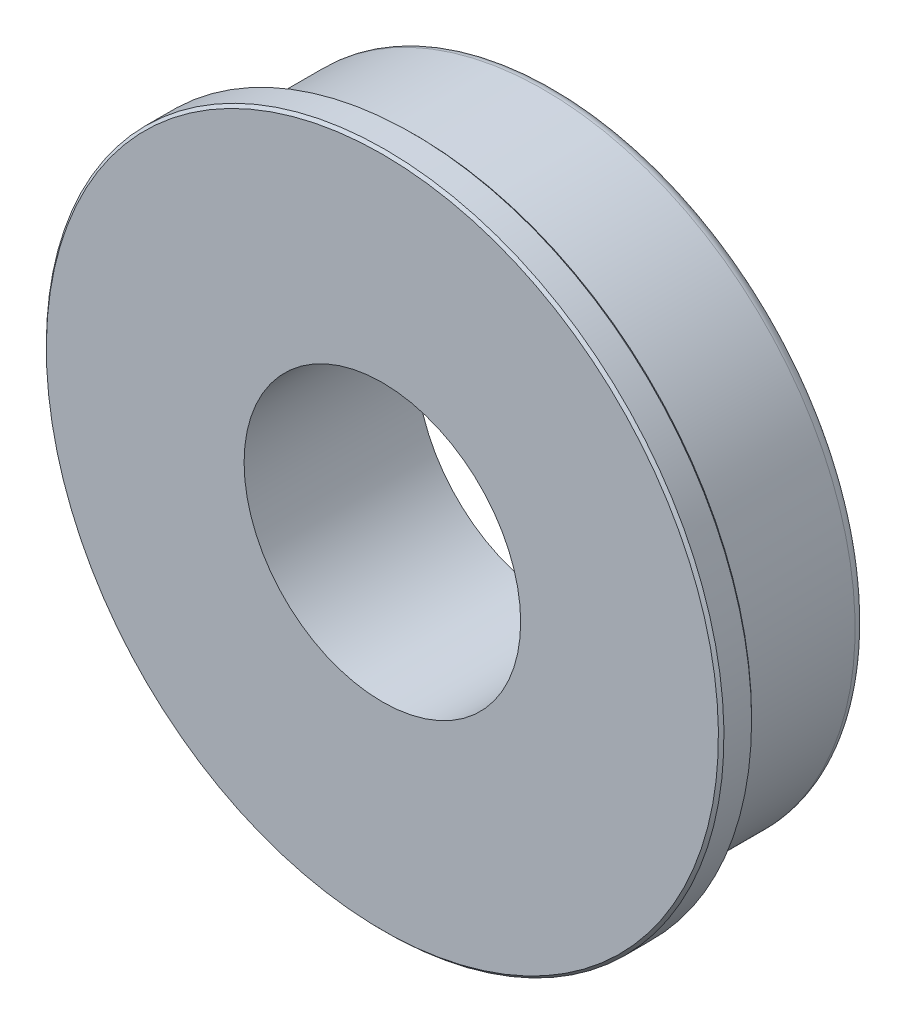
ISO-10303-21;
HEADER;
FILE_DESCRIPTION(('STEP AP214'),'2;1');
FILE_NAME('part.step','',(''),(''),'','','');
FILE_SCHEMA(('AUTOMOTIVE_DESIGN { 1 0 10303 214 1 1 1 1 }'));
ENDSEC;
DATA;
#1=APPLICATION_CONTEXT('core data for automotive mechanical design processes');
#2=APPLICATION_PROTOCOL_DEFINITION('international standard','automotive_design',2000,#1);
#3=PRODUCT_CONTEXT('',#1,'mechanical');
#4=PRODUCT('Part','Part','',(#3));
#5=PRODUCT_RELATED_PRODUCT_CATEGORY('part','',(#4));
#6=PRODUCT_DEFINITION_FORMATION('','',#4);
#7=PRODUCT_DEFINITION_CONTEXT('part definition',#1,'design');
#8=PRODUCT_DEFINITION('design','',#6,#7);
#9=PRODUCT_DEFINITION_SHAPE('','',#8);
#10=(LENGTH_UNIT() NAMED_UNIT(*) SI_UNIT(.MILLI.,.METRE.));
#11=(NAMED_UNIT(*) PLANE_ANGLE_UNIT() SI_UNIT($,.RADIAN.));
#12=(NAMED_UNIT(*) SI_UNIT($,.STERADIAN.) SOLID_ANGLE_UNIT());
#13=UNCERTAINTY_MEASURE_WITH_UNIT(LENGTH_MEASURE(1.E-05),#10,'distance_accuracy_value','');
#14=(GEOMETRIC_REPRESENTATION_CONTEXT(3) GLOBAL_UNCERTAINTY_ASSIGNED_CONTEXT((#13)) GLOBAL_UNIT_ASSIGNED_CONTEXT((#10,
#11,#12)) REPRESENTATION_CONTEXT('',''));
#15=CARTESIAN_POINT('',(0.,0.,0.));
#16=DIRECTION('',(0.,0.,1.));
#17=DIRECTION('',(1.,0.,0.));
#18=AXIS2_PLACEMENT_3D('',#15,#16,#17);
#19=CARTESIAN_POINT('',(0.,0.,-57.007125));
#20=DIRECTION('',(0.,0.,1.));
#21=DIRECTION('',(1.,0.,0.));
#22=AXIS2_PLACEMENT_3D('',#19,#20,#21);
#23=CYLINDRICAL_SURFACE('',#22,13.97);
#24=CARTESIAN_POINT('',(0.,0.,6.40334000025399));
#25=DIRECTION('',(0.,0.,1.));
#26=DIRECTION('',(1.,0.,0.));
#27=AXIS2_PLACEMENT_3D('',#24,#25,#26);
#28=CIRCLE('',#27,13.97);
#29=CARTESIAN_POINT('',(13.97,0.,6.40334000025399));
#30=VERTEX_POINT('',#29);
#31=EDGE_CURVE('E51',#30,#30,#28,.T.);
#32=ORIENTED_EDGE('',*,*,#31,.F.);
#33=EDGE_LOOP('',(#32));
#34=FACE_BOUND('',#33,.T.);
#35=CARTESIAN_POINT('',(0.,0.,5.895340000254));
#36=DIRECTION('',(0.,0.,1.));
#37=DIRECTION('',(1.,0.,0.));
#38=AXIS2_PLACEMENT_3D('',#35,#36,#37);
#39=CIRCLE('',#38,13.97);
#40=CARTESIAN_POINT('',(13.97,0.,5.895340000254));
#41=VERTEX_POINT('',#40);
#42=EDGE_CURVE('E48',#41,#41,#39,.T.);
#43=ORIENTED_EDGE('',*,*,#42,.T.);
#44=EDGE_LOOP('',(#43));
#45=FACE_BOUND('',#44,.T.);
#46=ADVANCED_FACE('F17',(#34,#45),#23,.T.);
#47=CARTESIAN_POINT('',(0.,47.3069264516129,5.89534));
#48=DIRECTION('',(0.,0.,-1.));
#49=DIRECTION('',(-1.,0.,0.));
#50=AXIS2_PLACEMENT_3D('',#47,#48,#49);
#51=PLANE('',#50);
#52=ORIENTED_EDGE('',*,*,#42,.F.);
#53=EDGE_LOOP('',(#52));
#54=FACE_BOUND('',#53,.T.);
#55=CARTESIAN_POINT('',(0.,0.,5.895340000254));
#56=DIRECTION('',(0.,0.,-1.));
#57=DIRECTION('',(-1.,0.,0.));
#58=AXIS2_PLACEMENT_3D('',#55,#56,#57);
#59=CIRCLE('',#58,14.2875);
#60=CARTESIAN_POINT('',(-14.2875,0.,5.895340000254));
#61=VERTEX_POINT('',#60);
#62=EDGE_CURVE('E54',#61,#61,#59,.T.);
#63=ORIENTED_EDGE('',*,*,#62,.F.);
#64=EDGE_LOOP('',(#63));
#65=FACE_BOUND('',#64,.T.);
#66=ADVANCED_FACE('F212',(#54,#65),#51,.F.);
#67=CARTESIAN_POINT('',(0.,0.,6.40334));
#68=DIRECTION('',(0.,0.,-1.));
#69=DIRECTION('',(-1.,0.,0.));
#70=AXIS2_PLACEMENT_3D('',#67,#68,#69);
#71=PLANE('',#70);
#72=ORIENTED_EDGE('',*,*,#31,.T.);
#73=EDGE_LOOP('',(#72));
#74=FACE_BOUND('',#73,.T.);
#75=CARTESIAN_POINT('',(0.,0.,6.40334000038116));
#76=DIRECTION('',(0.,0.,1.));
#77=DIRECTION('',(1.,0.,0.));
#78=AXIS2_PLACEMENT_3D('',#75,#76,#77);
#79=CIRCLE('',#78,15.4305000003808);
#80=CARTESIAN_POINT('',(15.4305000003808,0.,6.40334000038116));
#81=VERTEX_POINT('',#80);
#82=EDGE_CURVE('E57',#81,#81,#79,.T.);
#83=ORIENTED_EDGE('',*,*,#82,.F.);
#84=EDGE_LOOP('',(#83));
#85=FACE_BOUND('',#84,.T.);
#86=ADVANCED_FACE('F203',(#74,#85),#71,.T.);
#87=CARTESIAN_POINT('',(0.,0.,6.40334));
#88=DIRECTION('',(0.,0.,-1.));
#89=DIRECTION('',(-1.,0.,0.));
#90=AXIS2_PLACEMENT_3D('',#87,#88,#89);
#91=CYLINDRICAL_SURFACE('',#90,14.2875);
#92=CARTESIAN_POINT('',(0.,0.,0.508000000000015));
#93=DIRECTION('',(0.,0.,-1.));
#94=DIRECTION('',(-1.,0.,0.));
#95=AXIS2_PLACEMENT_3D('',#92,#93,#94);
#96=CIRCLE('',#95,14.2875);
#97=CARTESIAN_POINT('',(-14.2875,0.,0.508000000000015));
#98=VERTEX_POINT('',#97);
#99=EDGE_CURVE('E60',#98,#98,#96,.T.);
#100=ORIENTED_EDGE('',*,*,#99,.F.);
#101=EDGE_LOOP('',(#100));
#102=FACE_BOUND('',#101,.T.);
#103=ORIENTED_EDGE('',*,*,#62,.T.);
#104=EDGE_LOOP('',(#103));
#105=FACE_BOUND('',#104,.T.);
#106=ADVANCED_FACE('F194',(#102,#105),#91,.T.);
#107=CARTESIAN_POINT('',(0.,0.,6.53034000038083));
#108=DIRECTION('',(0.,0.,1.));
#109=DIRECTION('',(1.,0.,0.));
#110=AXIS2_PLACEMENT_3D('',#107,#108,#109);
#111=CONICAL_SURFACE('',#110,15.5575000003812,0.785398163399999);
#112=ORIENTED_EDGE('',*,*,#82,.T.);
#113=EDGE_LOOP('',(#112));
#114=FACE_BOUND('',#113,.T.);
#115=CARTESIAN_POINT('',(0.,0.,6.530340000254));
#116=DIRECTION('',(0.,0.,-1.));
#117=DIRECTION('',(-1.,0.,0.));
#118=AXIS2_PLACEMENT_3D('',#115,#116,#117);
#119=CIRCLE('',#118,15.5575);
#120=CARTESIAN_POINT('',(-15.5575,0.,6.530340000254));
#121=VERTEX_POINT('',#120);
#122=EDGE_CURVE('E46',#121,#121,#119,.F.);
#123=ORIENTED_EDGE('',*,*,#122,.F.);
#124=EDGE_LOOP('',(#123));
#125=FACE_BOUND('',#124,.T.);
#126=ADVANCED_FACE('F81',(#114,#125),#111,.T.);
#127=CARTESIAN_POINT('',(0.,0.,0.508000000000015));
#128=DIRECTION('',(0.,0.,-1.));
#129=DIRECTION('',(-1.,0.,0.));
#130=AXIS2_PLACEMENT_3D('',#127,#128,#129);
#131=TOROIDAL_SURFACE('',#130,13.7795,0.508);
#132=ORIENTED_EDGE('',*,*,#99,.T.);
#133=EDGE_LOOP('',(#132));
#134=FACE_BOUND('',#133,.T.);
#135=CARTESIAN_POINT('',(0.,0.,0.));
#136=DIRECTION('',(0.,0.,1.));
#137=DIRECTION('',(-1.,0.,0.));
#138=AXIS2_PLACEMENT_3D('',#135,#136,#137);
#139=CIRCLE('',#138,13.7795);
#140=CARTESIAN_POINT('',(13.7795,0.,0.));
#141=VERTEX_POINT('',#140);
#142=CARTESIAN_POINT('',(-13.7795,0.,0.));
#143=VERTEX_POINT('',#142);
#144=EDGE_CURVE('E37',#141,#143,#139,.F.);
#145=ORIENTED_EDGE('',*,*,#144,.F.);
#146=CARTESIAN_POINT('',(0.,0.,0.));
#147=DIRECTION('',(0.,0.,1.));
#148=DIRECTION('',(1.,0.,0.));
#149=AXIS2_PLACEMENT_3D('',#146,#147,#148);
#150=CIRCLE('',#149,13.7795);
#151=EDGE_CURVE('E34',#143,#141,#150,.F.);
#152=ORIENTED_EDGE('',*,*,#151,.F.);
#153=EDGE_LOOP('',(#145,#152));
#154=FACE_BOUND('',#153,.T.);
#155=ADVANCED_FACE('F45',(#134,#154),#131,.T.);
#156=CARTESIAN_POINT('',(0.,0.,7.92734));
#157=DIRECTION('',(0.,0.,-1.));
#158=DIRECTION('',(-1.,0.,0.));
#159=AXIS2_PLACEMENT_3D('',#156,#157,#158);
#160=CYLINDRICAL_SURFACE('',#159,15.5575);
#161=ORIENTED_EDGE('',*,*,#122,.T.);
#162=EDGE_LOOP('',(#161));
#163=FACE_BOUND('',#162,.T.);
#164=CARTESIAN_POINT('',(0.,0.,7.80034000012699));
#165=DIRECTION('',(0.,0.,-1.));
#166=DIRECTION('',(-1.,0.,0.));
#167=AXIS2_PLACEMENT_3D('',#164,#165,#166);
#168=CIRCLE('',#167,15.557499999873);
#169=CARTESIAN_POINT('',(-15.557499999873,0.,7.80034000012699));
#170=VERTEX_POINT('',#169);
#171=EDGE_CURVE('E42',#170,#170,#168,.F.);
#172=ORIENTED_EDGE('',*,*,#171,.F.);
#173=EDGE_LOOP('',(#172));
#174=FACE_BOUND('',#173,.T.);
#175=ADVANCED_FACE('F80',(#163,#174),#160,.T.);
#176=CARTESIAN_POINT('',(0.,0.,0.));
#177=DIRECTION('',(0.,0.,-1.));
#178=DIRECTION('',(-1.,0.,0.));
#179=AXIS2_PLACEMENT_3D('',#176,#177,#178);
#180=PLANE('',#179);
#181=CARTESIAN_POINT('',(0.,0.,0.));
#182=DIRECTION('',(0.,0.,1.));
#183=DIRECTION('',(1.,0.,0.));
#184=AXIS2_PLACEMENT_3D('',#181,#182,#183);
#185=CIRCLE('',#184,6.35);
#186=CARTESIAN_POINT('',(6.35000000000001,0.,0.));
#187=VERTEX_POINT('',#186);
#188=EDGE_CURVE('E61',#187,#187,#185,.T.);
#189=ORIENTED_EDGE('',*,*,#188,.T.);
#190=EDGE_LOOP('',(#189));
#191=FACE_BOUND('',#190,.T.);
#192=ORIENTED_EDGE('',*,*,#151,.T.);
#193=ORIENTED_EDGE('',*,*,#144,.T.);
#194=EDGE_LOOP('',(#192,#193));
#195=FACE_BOUND('',#194,.T.);
#196=ADVANCED_FACE('F39',(#191,#195),#180,.T.);
#197=CARTESIAN_POINT('',(0.,0.,7.80034000012699));
#198=DIRECTION('',(0.,0.,-1.));
#199=DIRECTION('',(0.,1.,0.));
#200=AXIS2_PLACEMENT_3D('',#197,#198,#199);
#201=CONICAL_SURFACE('',#200,15.557499999873,0.785398163399996);
#202=CARTESIAN_POINT('',(0.,0.,7.92734000012666));
#203=DIRECTION('',(0.,0.,-1.));
#204=DIRECTION('',(0.,1.,0.));
#205=AXIS2_PLACEMENT_3D('',#202,#203,#204);
#206=CIRCLE('',#205,15.4304999998727);
#207=CARTESIAN_POINT('',(0.,15.4304999998727,7.92734000012666));
#208=VERTEX_POINT('',#207);
#209=EDGE_CURVE('E27',#208,#208,#206,.T.);
#210=ORIENTED_EDGE('',*,*,#209,.T.);
#211=EDGE_LOOP('',(#210));
#212=FACE_BOUND('',#211,.T.);
#213=ORIENTED_EDGE('',*,*,#171,.T.);
#214=EDGE_LOOP('',(#213));
#215=FACE_BOUND('',#214,.T.);
#216=ADVANCED_FACE('F101',(#212,#215),#201,.T.);
#217=CARTESIAN_POINT('',(0.,0.,7.92734));
#218=DIRECTION('',(0.,0.,1.));
#219=DIRECTION('',(1.,0.,0.));
#220=AXIS2_PLACEMENT_3D('',#217,#218,#219);
#221=CYLINDRICAL_SURFACE('',#220,6.35);
#222=CARTESIAN_POINT('',(0.,0.,7.927340000254));
#223=DIRECTION('',(0.,0.,1.));
#224=DIRECTION('',(1.,0.,0.));
#225=AXIS2_PLACEMENT_3D('',#222,#223,#224);
#226=CIRCLE('',#225,6.35);
#227=CARTESIAN_POINT('',(6.35000000000001,0.,7.927340000254));
#228=VERTEX_POINT('',#227);
#229=EDGE_CURVE('E11',#228,#228,#226,.T.);
#230=ORIENTED_EDGE('',*,*,#229,.T.);
#231=EDGE_LOOP('',(#230));
#232=FACE_BOUND('',#231,.T.);
#233=ORIENTED_EDGE('',*,*,#188,.F.);
#234=EDGE_LOOP('',(#233));
#235=FACE_BOUND('',#234,.T.);
#236=ADVANCED_FACE('F126',(#232,#235),#221,.F.);
#237=CARTESIAN_POINT('',(0.,0.,7.92734));
#238=DIRECTION('',(0.,0.,-1.));
#239=DIRECTION('',(-1.,0.,0.));
#240=AXIS2_PLACEMENT_3D('',#237,#238,#239);
#241=PLANE('',#240);
#242=ORIENTED_EDGE('',*,*,#229,.F.);
#243=EDGE_LOOP('',(#242));
#244=FACE_BOUND('',#243,.T.);
#245=ORIENTED_EDGE('',*,*,#209,.F.);
#246=EDGE_LOOP('',(#245));
#247=FACE_BOUND('',#246,.T.);
#248=ADVANCED_FACE('F124',(#244,#247),#241,.F.);
#249=CLOSED_SHELL('',(#46,#66,#86,#106,#126,#155,#175,#196,#216,#236,#248));
#250=MANIFOLD_SOLID_BREP('B1',#249);
#251=ADVANCED_BREP_SHAPE_REPRESENTATION('',(#18,#250),#14);
#252=SHAPE_DEFINITION_REPRESENTATION(#9,#251);
ENDSEC;
END-ISO-10303-21;
